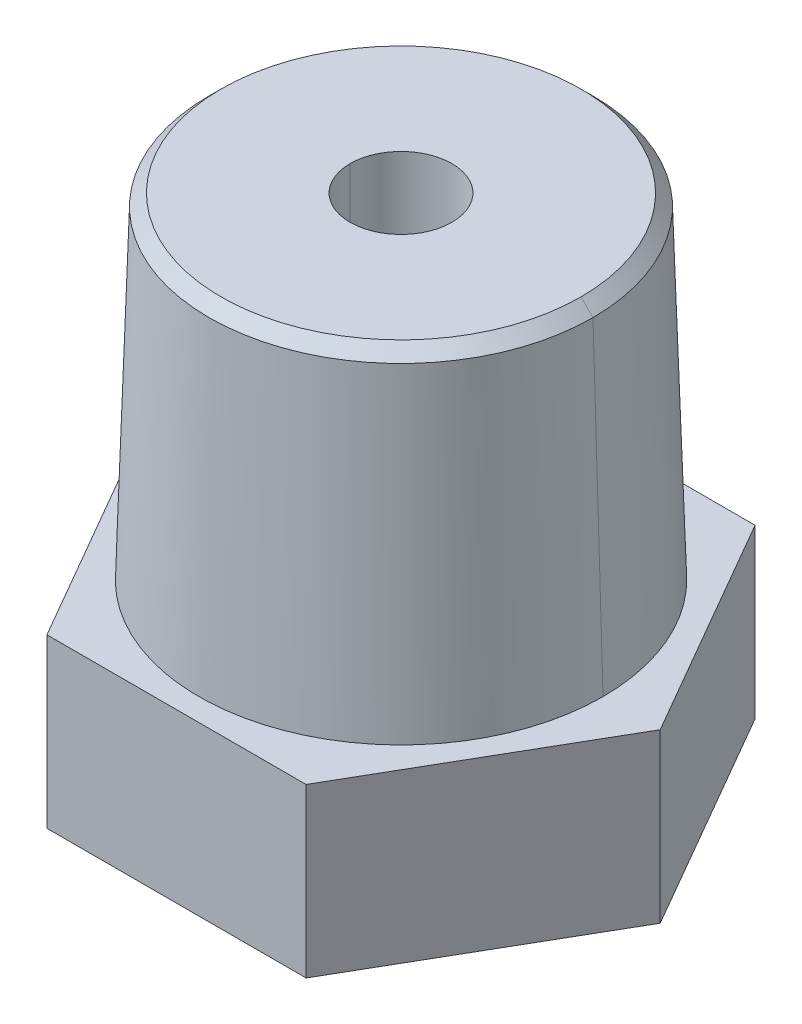
ISO-10303-21;
HEADER;
FILE_DESCRIPTION(('STEP AP214'),'2;1');
FILE_NAME('part.step','',(''),(''),'','','');
FILE_SCHEMA(('AUTOMOTIVE_DESIGN { 1 0 10303 214 1 1 1 1 }'));
ENDSEC;
DATA;
#1=APPLICATION_CONTEXT('core data for automotive mechanical design processes');
#2=APPLICATION_PROTOCOL_DEFINITION('international standard','automotive_design',2000,#1);
#3=PRODUCT_CONTEXT('',#1,'mechanical');
#4=PRODUCT('Part','Part','',(#3));
#5=PRODUCT_RELATED_PRODUCT_CATEGORY('part','',(#4));
#6=PRODUCT_DEFINITION_FORMATION('','',#4);
#7=PRODUCT_DEFINITION_CONTEXT('part definition',#1,'design');
#8=PRODUCT_DEFINITION('design','',#6,#7);
#9=PRODUCT_DEFINITION_SHAPE('','',#8);
#10=(LENGTH_UNIT() NAMED_UNIT(*) SI_UNIT(.MILLI.,.METRE.));
#11=(NAMED_UNIT(*) PLANE_ANGLE_UNIT() SI_UNIT($,.RADIAN.));
#12=(NAMED_UNIT(*) SI_UNIT($,.STERADIAN.) SOLID_ANGLE_UNIT());
#13=UNCERTAINTY_MEASURE_WITH_UNIT(LENGTH_MEASURE(1.E-05),#10,'distance_accuracy_value','');
#14=(GEOMETRIC_REPRESENTATION_CONTEXT(3) GLOBAL_UNCERTAINTY_ASSIGNED_CONTEXT((#13)) GLOBAL_UNIT_ASSIGNED_CONTEXT((#10,
#11,#12)) REPRESENTATION_CONTEXT('',''));
#15=CARTESIAN_POINT('',(0.,0.,0.));
#16=DIRECTION('',(0.,0.,1.));
#17=DIRECTION('',(1.,0.,0.));
#18=AXIS2_PLACEMENT_3D('',#15,#16,#17);
#19=CARTESIAN_POINT('',(0.,0.,0.));
#20=DIRECTION('',(0.,1.,0.));
#21=DIRECTION('',(0.,0.,1.));
#22=AXIS2_PLACEMENT_3D('',#19,#20,#21);
#23=CYLINDRICAL_SURFACE('',#22,5.5626);
#24=CARTESIAN_POINT('',(0.,14.478,0.));
#25=DIRECTION('',(0.,1.,0.));
#26=DIRECTION('',(0.,0.,1.));
#27=AXIS2_PLACEMENT_3D('',#24,#25,#26);
#28=CIRCLE('',#27,5.5626);
#29=CARTESIAN_POINT('',(-5.5626,14.478,0.));
#30=VERTEX_POINT('',#29);
#31=CARTESIAN_POINT('',(5.5626,14.478,0.));
#32=VERTEX_POINT('',#31);
#33=EDGE_CURVE('E20',#30,#32,#28,.T.);
#34=ORIENTED_EDGE('',*,*,#33,.T.);
#35=DIRECTION('',(0.,1.,0.));
#36=VECTOR('',#35,1.);
#37=CARTESIAN_POINT('',(5.5626,0.,0.));
#38=LINE('',#37,#36);
#39=CARTESIAN_POINT('',(5.56259999998571,2.36220000002333,0.));
#40=VERTEX_POINT('',#39);
#41=EDGE_CURVE('E88',#32,#40,#38,.F.);
#42=ORIENTED_EDGE('',*,*,#41,.T.);
#43=CARTESIAN_POINT('',(0.,2.36219999999321,0.));
#44=DIRECTION('',(0.,-1.,0.));
#45=DIRECTION('',(1.,0.,0.));
#46=AXIS2_PLACEMENT_3D('',#43,#44,#45);
#47=CIRCLE('',#46,5.56259999999043);
#48=CARTESIAN_POINT('',(-5.56259999998571,2.36220000003584,0.));
#49=VERTEX_POINT('',#48);
#50=EDGE_CURVE('E86',#40,#49,#47,.T.);
#51=ORIENTED_EDGE('',*,*,#50,.T.);
#52=DIRECTION('',(0.,1.,0.));
#53=VECTOR('',#52,1.);
#54=CARTESIAN_POINT('',(-5.5626,0.,0.));
#55=LINE('',#54,#53);
#56=EDGE_CURVE('E80',#49,#30,#55,.T.);
#57=ORIENTED_EDGE('',*,*,#56,.T.);
#58=EDGE_LOOP('',(#34,#42,#51,#57));
#59=FACE_BOUND('',#58,.T.);
#60=ADVANCED_FACE('F17',(#59),#23,.F.);
#61=CARTESIAN_POINT('',(0.,0.,0.));
#62=DIRECTION('',(0.,1.,0.));
#63=DIRECTION('',(0.,0.,1.));
#64=AXIS2_PLACEMENT_3D('',#61,#62,#63);
#65=CYLINDRICAL_SURFACE('',#64,5.5626);
#66=CARTESIAN_POINT('',(0.,14.478,0.));
#67=DIRECTION('',(0.,1.,0.));
#68=DIRECTION('',(0.,0.,1.));
#69=AXIS2_PLACEMENT_3D('',#66,#67,#68);
#70=CIRCLE('',#69,5.5626);
#71=EDGE_CURVE('E219',#32,#30,#70,.T.);
#72=ORIENTED_EDGE('',*,*,#71,.T.);
#73=ORIENTED_EDGE('',*,*,#56,.F.);
#74=CARTESIAN_POINT('',(0.,2.36219999999321,0.));
#75=DIRECTION('',(0.,-1.,0.));
#76=DIRECTION('',(1.,0.,0.));
#77=AXIS2_PLACEMENT_3D('',#74,#75,#76);
#78=CIRCLE('',#77,5.56259999999043);
#79=EDGE_CURVE('E215',#49,#40,#78,.T.);
#80=ORIENTED_EDGE('',*,*,#79,.T.);
#81=ORIENTED_EDGE('',*,*,#41,.F.);
#82=EDGE_LOOP('',(#72,#73,#80,#81));
#83=FACE_BOUND('',#82,.T.);
#84=ADVANCED_FACE('F240',(#83),#65,.F.);
#85=CARTESIAN_POINT('',(0.,14.478,0.));
#86=DIRECTION('',(0.,1.,0.));
#87=DIRECTION('',(0.,0.,1.));
#88=AXIS2_PLACEMENT_3D('',#85,#86,#87);
#89=PLANE('',#88);
#90=CARTESIAN_POINT('',(0.,14.478,0.));
#91=DIRECTION('',(0.,-1.,0.));
#92=DIRECTION('',(0.,0.,-1.));
#93=AXIS2_PLACEMENT_3D('',#90,#91,#92);
#94=CIRCLE('',#93,2.159);
#95=CARTESIAN_POINT('',(-2.159,14.478,0.));
#96=VERTEX_POINT('',#95);
#97=CARTESIAN_POINT('',(2.159,14.478,0.));
#98=VERTEX_POINT('',#97);
#99=EDGE_CURVE('E214',#96,#98,#94,.F.);
#100=ORIENTED_EDGE('',*,*,#99,.T.);
#101=CARTESIAN_POINT('',(0.,14.478,0.));
#102=DIRECTION('',(0.,-1.,0.));
#103=DIRECTION('',(0.,0.,-1.));
#104=AXIS2_PLACEMENT_3D('',#101,#102,#103);
#105=CIRCLE('',#104,2.159);
#106=EDGE_CURVE('E208',#98,#96,#105,.F.);
#107=ORIENTED_EDGE('',*,*,#106,.T.);
#108=EDGE_LOOP('',(#100,#107));
#109=FACE_BOUND('',#108,.T.);
#110=ORIENTED_EDGE('',*,*,#33,.F.);
#111=ORIENTED_EDGE('',*,*,#71,.F.);
#112=EDGE_LOOP('',(#110,#111));
#113=FACE_BOUND('',#112,.T.);
#114=ADVANCED_FACE('F243',(#109,#113),#89,.F.);
#115=CARTESIAN_POINT('',(0.,1.70530256582424E-10,0.));
#116=DIRECTION('',(0.,-1.,0.));
#117=DIRECTION('',(0.,0.,-1.));
#118=AXIS2_PLACEMENT_3D('',#115,#116,#117);
#119=CONICAL_SURFACE('',#118,6.06470110992063,0.209439510237388);
#120=ORIENTED_EDGE('',*,*,#50,.F.);
#121=DIRECTION('',(-0.207911690817721,0.978147600733814,0.));
#122=VECTOR('',#121,1.);
#123=CARTESIAN_POINT('',(106071.78897443,-499000.,0.));
#124=LINE('',#123,#122);
#125=CARTESIAN_POINT('',(6.06470110994693,5.6843418860808E-11,0.));
#126=VERTEX_POINT('',#125);
#127=EDGE_CURVE('E212',#40,#126,#124,.F.);
#128=ORIENTED_EDGE('',*,*,#127,.T.);
#129=CARTESIAN_POINT('',(0.,5.6843418860808E-11,0.));
#130=DIRECTION('',(0.,-1.,0.));
#131=DIRECTION('',(0.,0.,-1.));
#132=AXIS2_PLACEMENT_3D('',#129,#130,#131);
#133=CIRCLE('',#132,6.0647011099448);
#134=CARTESIAN_POINT('',(-6.06470110994693,5.6843418860808E-11,0.));
#135=VERTEX_POINT('',#134);
#136=EDGE_CURVE('E211',#126,#135,#133,.T.);
#137=ORIENTED_EDGE('',*,*,#136,.T.);
#138=DIRECTION('',(0.207911690817721,0.978147600733814,0.));
#139=VECTOR('',#138,1.);
#140=CARTESIAN_POINT('',(-106071.78897443,-499000.,1.2990047684737E-11));
#141=LINE('',#140,#139);
#142=EDGE_CURVE('E216',#135,#49,#141,.T.);
#143=ORIENTED_EDGE('',*,*,#142,.T.);
#144=EDGE_LOOP('',(#120,#128,#137,#143));
#145=FACE_BOUND('',#144,.T.);
#146=ADVANCED_FACE('F245',(#145),#119,.F.);
#147=CARTESIAN_POINT('',(0.,1.70530256582424E-10,0.));
#148=DIRECTION('',(0.,-1.,0.));
#149=DIRECTION('',(0.,0.,-1.));
#150=AXIS2_PLACEMENT_3D('',#147,#148,#149);
#151=CONICAL_SURFACE('',#150,6.06470110992063,0.209439510237388);
#152=ORIENTED_EDGE('',*,*,#79,.F.);
#153=ORIENTED_EDGE('',*,*,#142,.F.);
#154=CARTESIAN_POINT('',(0.,5.6843418860808E-11,0.));
#155=DIRECTION('',(0.,-1.,0.));
#156=DIRECTION('',(0.,0.,-1.));
#157=AXIS2_PLACEMENT_3D('',#154,#155,#156);
#158=CIRCLE('',#157,6.0647011099448);
#159=EDGE_CURVE('E233',#135,#126,#158,.T.);
#160=ORIENTED_EDGE('',*,*,#159,.T.);
#161=ORIENTED_EDGE('',*,*,#127,.F.);
#162=EDGE_LOOP('',(#152,#153,#160,#161));
#163=FACE_BOUND('',#162,.T.);
#164=ADVANCED_FACE('F253',(#163),#151,.F.);
#165=CARTESIAN_POINT('',(0.,21.336,0.));
#166=DIRECTION('',(0.,-1.,0.));
#167=DIRECTION('',(0.,0.,-1.));
#168=AXIS2_PLACEMENT_3D('',#165,#166,#167);
#169=CYLINDRICAL_SURFACE('',#168,2.159);
#170=CARTESIAN_POINT('',(0.,21.336,0.));
#171=DIRECTION('',(0.,-1.,0.));
#172=DIRECTION('',(0.,0.,-1.));
#173=AXIS2_PLACEMENT_3D('',#170,#171,#172);
#174=CIRCLE('',#173,2.159);
#175=CARTESIAN_POINT('',(-2.159,21.336,0.));
#176=VERTEX_POINT('',#175);
#177=CARTESIAN_POINT('',(2.159,21.336,0.));
#178=VERTEX_POINT('',#177);
#179=EDGE_CURVE('E231',#176,#178,#174,.F.);
#180=ORIENTED_EDGE('',*,*,#179,.T.);
#181=DIRECTION('',(0.,-1.,0.));
#182=VECTOR('',#181,1.);
#183=CARTESIAN_POINT('',(2.159,21.336,0.));
#184=LINE('',#183,#182);
#185=EDGE_CURVE('E207',#178,#98,#184,.T.);
#186=ORIENTED_EDGE('',*,*,#185,.T.);
#187=ORIENTED_EDGE('',*,*,#99,.F.);
#188=DIRECTION('',(0.,-1.,0.));
#189=VECTOR('',#188,1.);
#190=CARTESIAN_POINT('',(-2.159,21.336,0.));
#191=LINE('',#190,#189);
#192=EDGE_CURVE('E205',#96,#176,#191,.F.);
#193=ORIENTED_EDGE('',*,*,#192,.T.);
#194=EDGE_LOOP('',(#180,#186,#187,#193));
#195=FACE_BOUND('',#194,.T.);
#196=ADVANCED_FACE('F308',(#195),#169,.F.);
#197=CARTESIAN_POINT('',(0.,21.336,0.));
#198=DIRECTION('',(0.,-1.,0.));
#199=DIRECTION('',(0.,0.,-1.));
#200=AXIS2_PLACEMENT_3D('',#197,#198,#199);
#201=CYLINDRICAL_SURFACE('',#200,2.159);
#202=CARTESIAN_POINT('',(0.,21.336,0.));
#203=DIRECTION('',(0.,-1.,0.));
#204=DIRECTION('',(0.,0.,-1.));
#205=AXIS2_PLACEMENT_3D('',#202,#203,#204);
#206=CIRCLE('',#205,2.159);
#207=EDGE_CURVE('E228',#178,#176,#206,.F.);
#208=ORIENTED_EDGE('',*,*,#207,.T.);
#209=ORIENTED_EDGE('',*,*,#192,.F.);
#210=ORIENTED_EDGE('',*,*,#106,.F.);
#211=ORIENTED_EDGE('',*,*,#185,.F.);
#212=EDGE_LOOP('',(#208,#209,#210,#211));
#213=FACE_BOUND('',#212,.T.);
#214=ADVANCED_FACE('F304',(#213),#201,.F.);
#215=CARTESIAN_POINT('',(0.,0.,0.));
#216=DIRECTION('',(0.,1.,0.));
#217=DIRECTION('',(0.,0.,1.));
#218=AXIS2_PLACEMENT_3D('',#215,#216,#217);
#219=PLANE('',#218);
#220=ORIENTED_EDGE('',*,*,#136,.F.);
#221=ORIENTED_EDGE('',*,*,#159,.F.);
#222=EDGE_LOOP('',(#220,#221));
#223=FACE_BOUND('',#222,.T.);
#224=DIRECTION('',(-0.500000000000017,0.,0.866025403784429));
#225=VECTOR('',#224,1.);
#226=CARTESIAN_POINT('',(-5.49926131403094,0.,-9.525));
#227=LINE('',#226,#225);
#228=CARTESIAN_POINT('',(-5.49926131403094,0.,-9.525));
#229=VERTEX_POINT('',#228);
#230=CARTESIAN_POINT('',(-10.9985226280621,0.,-1.03852042569284E-13));
#231=VERTEX_POINT('',#230);
#232=EDGE_CURVE('E187',#229,#231,#227,.T.);
#233=ORIENTED_EDGE('',*,*,#232,.F.);
#234=DIRECTION('',(-1.,0.,0.));
#235=VECTOR('',#234,1.);
#236=CARTESIAN_POINT('',(5.49926131403094,0.,-9.525));
#237=LINE('',#236,#235);
#238=CARTESIAN_POINT('',(5.49926131403075,0.,-9.5249999999999));
#239=VERTEX_POINT('',#238);
#240=EDGE_CURVE('E192',#239,#229,#237,.T.);
#241=ORIENTED_EDGE('',*,*,#240,.F.);
#242=DIRECTION('',(-0.500000000000017,0.,-0.866025403784429));
#243=VECTOR('',#242,1.);
#244=CARTESIAN_POINT('',(10.9985226280619,0.,0.));
#245=LINE('',#244,#243);
#246=CARTESIAN_POINT('',(10.9985226280621,0.,1.03852042569284E-13));
#247=VERTEX_POINT('',#246);
#248=EDGE_CURVE('E197',#247,#239,#245,.T.);
#249=ORIENTED_EDGE('',*,*,#248,.F.);
#250=DIRECTION('',(0.500000000000017,0.,-0.866025403784429));
#251=VECTOR('',#250,1.);
#252=CARTESIAN_POINT('',(5.49926131403094,0.,9.525));
#253=LINE('',#252,#251);
#254=CARTESIAN_POINT('',(5.49926131403094,0.,9.525));
#255=VERTEX_POINT('',#254);
#256=EDGE_CURVE('E202',#255,#247,#253,.T.);
#257=ORIENTED_EDGE('',*,*,#256,.F.);
#258=DIRECTION('',(1.,0.,0.));
#259=VECTOR('',#258,1.);
#260=CARTESIAN_POINT('',(-5.49926131403094,0.,9.525));
#261=LINE('',#260,#259);
#262=CARTESIAN_POINT('',(-5.49926131403075,0.,9.5249999999999));
#263=VERTEX_POINT('',#262);
#264=EDGE_CURVE('E139',#263,#255,#261,.T.);
#265=ORIENTED_EDGE('',*,*,#264,.F.);
#266=DIRECTION('',(0.500000000000017,0.,0.866025403784429));
#267=VECTOR('',#266,1.);
#268=CARTESIAN_POINT('',(-10.9985226280619,0.,0.));
#269=LINE('',#268,#267);
#270=EDGE_CURVE('E135',#231,#263,#269,.T.);
#271=ORIENTED_EDGE('',*,*,#270,.F.);
#272=EDGE_LOOP('',(#233,#241,#249,#257,#265,#271));
#273=FACE_BOUND('',#272,.T.);
#274=ADVANCED_FACE('F300',(#223,#273),#219,.F.);
#275=CARTESIAN_POINT('',(0.,21.336,0.));
#276=DIRECTION('',(0.,-1.,0.));
#277=DIRECTION('',(0.,0.,-1.));
#278=AXIS2_PLACEMENT_3D('',#275,#276,#277);
#279=PLANE('',#278);
#280=ORIENTED_EDGE('',*,*,#179,.F.);
#281=ORIENTED_EDGE('',*,*,#207,.F.);
#282=EDGE_LOOP('',(#280,#281));
#283=FACE_BOUND('',#282,.T.);
#284=CARTESIAN_POINT('',(0.,21.336,0.));
#285=DIRECTION('',(0.,-1.,0.));
#286=DIRECTION('',(0.,0.,-1.));
#287=AXIS2_PLACEMENT_3D('',#284,#285,#286);
#288=CIRCLE('',#287,7.63824979824256);
#289=CARTESIAN_POINT('',(-7.63824979824256,21.336,0.));
#290=VERTEX_POINT('',#289);
#291=CARTESIAN_POINT('',(7.63824979824256,21.336,0.));
#292=VERTEX_POINT('',#291);
#293=EDGE_CURVE('E204',#290,#292,#288,.T.);
#294=ORIENTED_EDGE('',*,*,#293,.F.);
#295=CARTESIAN_POINT('',(0.,21.336,0.));
#296=DIRECTION('',(0.,-1.,0.));
#297=DIRECTION('',(0.,0.,-1.));
#298=AXIS2_PLACEMENT_3D('',#295,#296,#297);
#299=CIRCLE('',#298,7.63824979824256);
#300=EDGE_CURVE('E179',#292,#290,#299,.T.);
#301=ORIENTED_EDGE('',*,*,#300,.F.);
#302=EDGE_LOOP('',(#294,#301));
#303=FACE_BOUND('',#302,.T.);
#304=ADVANCED_FACE('F296',(#283,#303),#279,.F.);
#305=CARTESIAN_POINT('',(0.,20.828,0.));
#306=DIRECTION('',(0.,-1.,0.));
#307=DIRECTION('',(0.,0.,-1.));
#308=AXIS2_PLACEMENT_3D('',#305,#306,#307);
#309=CONICAL_SURFACE('',#308,8.14624979824248,0.785398163397301);
#310=ORIENTED_EDGE('',*,*,#293,.T.);
#311=DIRECTION('',(-0.707106781186443,0.707106781186652,0.));
#312=VECTOR('',#311,1.);
#313=CARTESIAN_POINT('',(7.89224979824252,21.082,0.));
#314=LINE('',#313,#312);
#315=CARTESIAN_POINT('',(8.14624979824277,20.828,0.));
#316=VERTEX_POINT('',#315);
#317=EDGE_CURVE('E173',#316,#292,#314,.T.);
#318=ORIENTED_EDGE('',*,*,#317,.F.);
#319=CARTESIAN_POINT('',(0.,20.828,0.));
#320=DIRECTION('',(0.,-1.,0.));
#321=DIRECTION('',(-1.,0.,0.));
#322=AXIS2_PLACEMENT_3D('',#319,#320,#321);
#323=CIRCLE('',#322,8.14624979824282);
#324=CARTESIAN_POINT('',(-8.14624979824274,20.828,0.));
#325=VERTEX_POINT('',#324);
#326=EDGE_CURVE('E164',#325,#316,#323,.T.);
#327=ORIENTED_EDGE('',*,*,#326,.F.);
#328=DIRECTION('',(0.707106781186443,0.707106781186652,0.));
#329=VECTOR('',#328,1.);
#330=CARTESIAN_POINT('',(-7.89224979824252,21.082,0.));
#331=LINE('',#330,#329);
#332=EDGE_CURVE('E176',#290,#325,#331,.F.);
#333=ORIENTED_EDGE('',*,*,#332,.F.);
#334=EDGE_LOOP('',(#310,#318,#327,#333));
#335=FACE_BOUND('',#334,.T.);
#336=ADVANCED_FACE('F292',(#335),#309,.T.);
#337=CARTESIAN_POINT('',(5.49926131403094,0.,9.525));
#338=DIRECTION('',(0.866025403784429,0.,0.500000000000017));
#339=DIRECTION('',(0.500000000000017,0.,-0.866025403784429));
#340=AXIS2_PLACEMENT_3D('',#337,#338,#339);
#341=PLANE('',#340);
#342=DIRECTION('',(0.,1.,0.));
#343=VECTOR('',#342,1.);
#344=CARTESIAN_POINT('',(5.49926131403094,0.,9.525));
#345=LINE('',#344,#343);
#346=CARTESIAN_POINT('',(5.49926131403094,7.112,9.525));
#347=VERTEX_POINT('',#346);
#348=EDGE_CURVE('E140',#255,#347,#345,.T.);
#349=ORIENTED_EDGE('',*,*,#348,.F.);
#350=ORIENTED_EDGE('',*,*,#256,.T.);
#351=DIRECTION('',(0.,1.,0.));
#352=VECTOR('',#351,1.);
#353=CARTESIAN_POINT('',(10.9985226280619,0.,0.));
#354=LINE('',#353,#352);
#355=CARTESIAN_POINT('',(10.9985226280621,7.112,1.03852042569284E-13));
#356=VERTEX_POINT('',#355);
#357=EDGE_CURVE('E199',#356,#247,#354,.F.);
#358=ORIENTED_EDGE('',*,*,#357,.F.);
#359=DIRECTION('',(0.499999999999983,0.,-0.866025403784448));
#360=VECTOR('',#359,1.);
#361=CARTESIAN_POINT('',(5.49926131403094,7.112,9.525));
#362=LINE('',#361,#360);
#363=EDGE_CURVE('E162',#347,#356,#362,.T.);
#364=ORIENTED_EDGE('',*,*,#363,.F.);
#365=EDGE_LOOP('',(#349,#350,#358,#364));
#366=FACE_BOUND('',#365,.T.);
#367=ADVANCED_FACE('F288',(#366),#341,.T.);
#368=CARTESIAN_POINT('',(10.9985226280619,0.,0.));
#369=DIRECTION('',(0.866025403784429,0.,-0.500000000000017));
#370=DIRECTION('',(-0.500000000000017,0.,-0.866025403784429));
#371=AXIS2_PLACEMENT_3D('',#368,#369,#370);
#372=PLANE('',#371);
#373=ORIENTED_EDGE('',*,*,#357,.T.);
#374=ORIENTED_EDGE('',*,*,#248,.T.);
#375=DIRECTION('',(0.,1.,0.));
#376=VECTOR('',#375,1.);
#377=CARTESIAN_POINT('',(5.49926131403094,0.,-9.525));
#378=LINE('',#377,#376);
#379=CARTESIAN_POINT('',(5.49926131403075,7.112,-9.5249999999999));
#380=VERTEX_POINT('',#379);
#381=EDGE_CURVE('E194',#380,#239,#378,.F.);
#382=ORIENTED_EDGE('',*,*,#381,.F.);
#383=DIRECTION('',(-0.499999999999983,0.,-0.866025403784448));
#384=VECTOR('',#383,1.);
#385=CARTESIAN_POINT('',(10.9985226280619,7.112,0.));
#386=LINE('',#385,#384);
#387=EDGE_CURVE('E159',#356,#380,#386,.T.);
#388=ORIENTED_EDGE('',*,*,#387,.F.);
#389=EDGE_LOOP('',(#373,#374,#382,#388));
#390=FACE_BOUND('',#389,.T.);
#391=ADVANCED_FACE('F284',(#390),#372,.T.);
#392=CARTESIAN_POINT('',(5.49926131403094,0.,-9.525));
#393=DIRECTION('',(0.,0.,-1.));
#394=DIRECTION('',(-1.,0.,0.));
#395=AXIS2_PLACEMENT_3D('',#392,#393,#394);
#396=PLANE('',#395);
#397=ORIENTED_EDGE('',*,*,#381,.T.);
#398=ORIENTED_EDGE('',*,*,#240,.T.);
#399=DIRECTION('',(0.,1.,0.));
#400=VECTOR('',#399,1.);
#401=CARTESIAN_POINT('',(-5.49926131403094,0.,-9.525));
#402=LINE('',#401,#400);
#403=CARTESIAN_POINT('',(-5.49926131403094,7.112,-9.525));
#404=VERTEX_POINT('',#403);
#405=EDGE_CURVE('E189',#404,#229,#402,.F.);
#406=ORIENTED_EDGE('',*,*,#405,.F.);
#407=DIRECTION('',(1.,0.,0.));
#408=VECTOR('',#407,1.);
#409=CARTESIAN_POINT('',(0.,7.112,-9.525));
#410=LINE('',#409,#408);
#411=EDGE_CURVE('E155',#380,#404,#410,.F.);
#412=ORIENTED_EDGE('',*,*,#411,.F.);
#413=EDGE_LOOP('',(#397,#398,#406,#412));
#414=FACE_BOUND('',#413,.T.);
#415=ADVANCED_FACE('F280',(#414),#396,.T.);
#416=CARTESIAN_POINT('',(-5.49926131403094,0.,-9.525));
#417=DIRECTION('',(-0.866025403784429,0.,-0.500000000000017));
#418=DIRECTION('',(-0.500000000000017,0.,0.866025403784429));
#419=AXIS2_PLACEMENT_3D('',#416,#417,#418);
#420=PLANE('',#419);
#421=ORIENTED_EDGE('',*,*,#405,.T.);
#422=ORIENTED_EDGE('',*,*,#232,.T.);
#423=DIRECTION('',(0.,1.,0.));
#424=VECTOR('',#423,1.);
#425=CARTESIAN_POINT('',(-10.9985226280619,0.,0.));
#426=LINE('',#425,#424);
#427=CARTESIAN_POINT('',(-10.9985226280621,7.112,-1.03852042569284E-13));
#428=VERTEX_POINT('',#427);
#429=EDGE_CURVE('E185',#428,#231,#426,.F.);
#430=ORIENTED_EDGE('',*,*,#429,.F.);
#431=DIRECTION('',(-0.499999999999983,0.,0.866025403784448));
#432=VECTOR('',#431,1.);
#433=CARTESIAN_POINT('',(-5.49926131403094,7.112,-9.525));
#434=LINE('',#433,#432);
#435=EDGE_CURVE('E153',#404,#428,#434,.T.);
#436=ORIENTED_EDGE('',*,*,#435,.F.);
#437=EDGE_LOOP('',(#421,#422,#430,#436));
#438=FACE_BOUND('',#437,.T.);
#439=ADVANCED_FACE('F277',(#438),#420,.T.);
#440=CARTESIAN_POINT('',(-10.9985226280619,0.,0.));
#441=DIRECTION('',(-0.866025403784429,0.,0.500000000000017));
#442=DIRECTION('',(0.500000000000017,0.,0.866025403784429));
#443=AXIS2_PLACEMENT_3D('',#440,#441,#442);
#444=PLANE('',#443);
#445=ORIENTED_EDGE('',*,*,#429,.T.);
#446=ORIENTED_EDGE('',*,*,#270,.T.);
#447=DIRECTION('',(0.,1.,0.));
#448=VECTOR('',#447,1.);
#449=CARTESIAN_POINT('',(-5.49926131403094,0.,9.525));
#450=LINE('',#449,#448);
#451=CARTESIAN_POINT('',(-5.49926131403075,7.112,9.5249999999999));
#452=VERTEX_POINT('',#451);
#453=EDGE_CURVE('E127',#452,#263,#450,.F.);
#454=ORIENTED_EDGE('',*,*,#453,.F.);
#455=DIRECTION('',(0.499999999999983,0.,0.866025403784448));
#456=VECTOR('',#455,1.);
#457=CARTESIAN_POINT('',(-10.9985226280619,7.112,0.));
#458=LINE('',#457,#456);
#459=EDGE_CURVE('E132',#428,#452,#458,.T.);
#460=ORIENTED_EDGE('',*,*,#459,.F.);
#461=EDGE_LOOP('',(#445,#446,#454,#460));
#462=FACE_BOUND('',#461,.T.);
#463=ADVANCED_FACE('F130',(#462),#444,.T.);
#464=CARTESIAN_POINT('',(-5.49926131403094,0.,9.525));
#465=DIRECTION('',(0.,0.,1.));
#466=DIRECTION('',(1.,0.,0.));
#467=AXIS2_PLACEMENT_3D('',#464,#465,#466);
#468=PLANE('',#467);
#469=ORIENTED_EDGE('',*,*,#453,.T.);
#470=ORIENTED_EDGE('',*,*,#264,.T.);
#471=ORIENTED_EDGE('',*,*,#348,.T.);
#472=DIRECTION('',(1.,0.,0.));
#473=VECTOR('',#472,1.);
#474=CARTESIAN_POINT('',(0.,7.112,9.525));
#475=LINE('',#474,#473);
#476=EDGE_CURVE('E144',#452,#347,#475,.T.);
#477=ORIENTED_EDGE('',*,*,#476,.F.);
#478=EDGE_LOOP('',(#469,#470,#471,#477));
#479=FACE_BOUND('',#478,.T.);
#480=ADVANCED_FACE('F145',(#479),#468,.T.);
#481=CARTESIAN_POINT('',(0.,20.828,0.));
#482=DIRECTION('',(0.,-1.,0.));
#483=DIRECTION('',(0.,0.,-1.));
#484=AXIS2_PLACEMENT_3D('',#481,#482,#483);
#485=CONICAL_SURFACE('',#484,8.14624979824248,0.785398163397301);
#486=CARTESIAN_POINT('',(0.,20.828,0.));
#487=DIRECTION('',(0.,-1.,0.));
#488=DIRECTION('',(-1.,0.,0.));
#489=AXIS2_PLACEMENT_3D('',#486,#487,#488);
#490=CIRCLE('',#489,8.14624979824282);
#491=EDGE_CURVE('E167',#316,#325,#490,.T.);
#492=ORIENTED_EDGE('',*,*,#491,.F.);
#493=ORIENTED_EDGE('',*,*,#317,.T.);
#494=ORIENTED_EDGE('',*,*,#300,.T.);
#495=ORIENTED_EDGE('',*,*,#332,.T.);
#496=EDGE_LOOP('',(#492,#493,#494,#495));
#497=FACE_BOUND('',#496,.T.);
#498=ADVANCED_FACE('F269',(#497),#485,.T.);
#499=CARTESIAN_POINT('',(0.,7.11200000000001,0.));
#500=DIRECTION('',(0.,-1.,0.));
#501=DIRECTION('',(0.,0.,-1.));
#502=AXIS2_PLACEMENT_3D('',#499,#500,#501);
#503=CONICAL_SURFACE('',#502,8.5724999999997,0.0310668606854931);
#504=DIRECTION('',(-0.0310618635640815,0.999517463895417,0.));
#505=VECTOR('',#504,1.);
#506=CARTESIAN_POINT('',(8.35937489912126,13.97,0.));
#507=LINE('',#506,#505);
#508=CARTESIAN_POINT('',(8.5724999999997,7.11200000000001,0.));
#509=VERTEX_POINT('',#508);
#510=EDGE_CURVE('E168',#509,#316,#507,.T.);
#511=ORIENTED_EDGE('',*,*,#510,.F.);
#512=CARTESIAN_POINT('',(0.,7.11200000000001,0.));
#513=DIRECTION('',(0.,-1.,0.));
#514=DIRECTION('',(0.,0.,-1.));
#515=AXIS2_PLACEMENT_3D('',#512,#513,#514);
#516=CIRCLE('',#515,8.5724999999997);
#517=CARTESIAN_POINT('',(-8.5724999999997,7.11200000000001,0.));
#518=VERTEX_POINT('',#517);
#519=EDGE_CURVE('E35',#518,#509,#516,.T.);
#520=ORIENTED_EDGE('',*,*,#519,.F.);
#521=DIRECTION('',(0.0310618635640815,0.999517463895417,0.));
#522=VECTOR('',#521,1.);
#523=CARTESIAN_POINT('',(-8.35937489912126,13.97,0.));
#524=LINE('',#523,#522);
#525=EDGE_CURVE('E26',#325,#518,#524,.F.);
#526=ORIENTED_EDGE('',*,*,#525,.F.);
#527=ORIENTED_EDGE('',*,*,#326,.T.);
#528=EDGE_LOOP('',(#511,#520,#526,#527));
#529=FACE_BOUND('',#528,.T.);
#530=ADVANCED_FACE('F263',(#529),#503,.T.);
#531=CARTESIAN_POINT('',(0.,7.112,0.));
#532=DIRECTION('',(0.,1.,0.));
#533=DIRECTION('',(0.,0.,1.));
#534=AXIS2_PLACEMENT_3D('',#531,#532,#533);
#535=PLANE('',#534);
#536=ORIENTED_EDGE('',*,*,#519,.T.);
#537=CARTESIAN_POINT('',(0.,7.11200000000001,0.));
#538=DIRECTION('',(0.,-1.,0.));
#539=DIRECTION('',(0.,0.,-1.));
#540=AXIS2_PLACEMENT_3D('',#537,#538,#539);
#541=CIRCLE('',#540,8.5724999999997);
#542=EDGE_CURVE('E11',#518,#509,#541,.F.);
#543=ORIENTED_EDGE('',*,*,#542,.F.);
#544=EDGE_LOOP('',(#536,#543));
#545=FACE_BOUND('',#544,.T.);
#546=ORIENTED_EDGE('',*,*,#459,.T.);
#547=ORIENTED_EDGE('',*,*,#476,.T.);
#548=ORIENTED_EDGE('',*,*,#363,.T.);
#549=ORIENTED_EDGE('',*,*,#387,.T.);
#550=ORIENTED_EDGE('',*,*,#411,.T.);
#551=ORIENTED_EDGE('',*,*,#435,.T.);
#552=EDGE_LOOP('',(#546,#547,#548,#549,#550,#551));
#553=FACE_BOUND('',#552,.T.);
#554=ADVANCED_FACE('F150',(#545,#553),#535,.T.);
#555=CARTESIAN_POINT('',(0.,7.11200000000001,0.));
#556=DIRECTION('',(0.,-1.,0.));
#557=DIRECTION('',(0.,0.,-1.));
#558=AXIS2_PLACEMENT_3D('',#555,#556,#557);
#559=CONICAL_SURFACE('',#558,8.5724999999997,0.0310668606854931);
#560=ORIENTED_EDGE('',*,*,#525,.T.);
#561=ORIENTED_EDGE('',*,*,#542,.T.);
#562=ORIENTED_EDGE('',*,*,#510,.T.);
#563=ORIENTED_EDGE('',*,*,#491,.T.);
#564=EDGE_LOOP('',(#560,#561,#562,#563));
#565=FACE_BOUND('',#564,.T.);
#566=ADVANCED_FACE('F256',(#565),#559,.T.);
#567=CLOSED_SHELL('',(#60,#84,#114,#146,#164,#196,#214,#274,#304,#336,#367,#391,#415,#439,#463,
#480,#498,#530,#554,#566));
#568=MANIFOLD_SOLID_BREP('B1',#567);
#569=ADVANCED_BREP_SHAPE_REPRESENTATION('',(#18,#568),#14);
#570=SHAPE_DEFINITION_REPRESENTATION(#9,#569);
ENDSEC;
END-ISO-10303-21;
